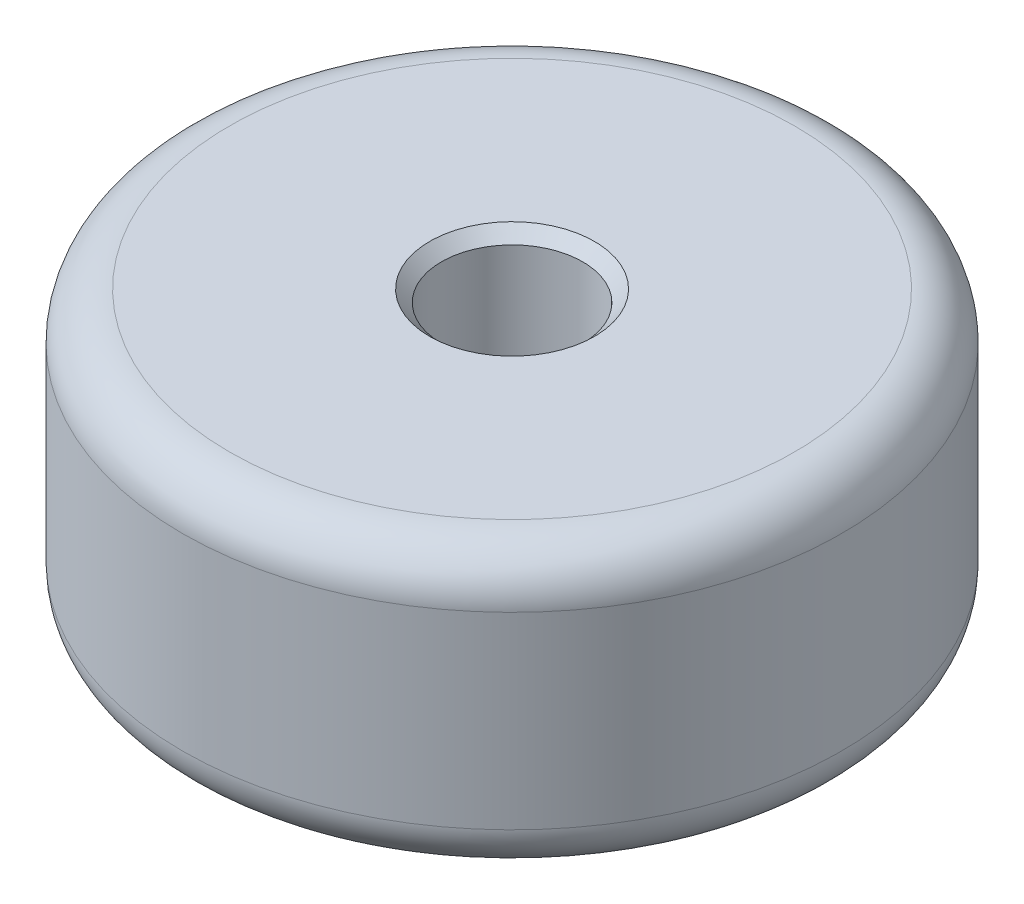
ISO-10303-21;
HEADER;
FILE_DESCRIPTION(('STEP AP214'),'2;1');
FILE_NAME('part.step','',(''),(''),'','','');
FILE_SCHEMA(('AUTOMOTIVE_DESIGN { 1 0 10303 214 1 1 1 1 }'));
ENDSEC;
DATA;
#1=APPLICATION_CONTEXT('core data for automotive mechanical design processes');
#2=APPLICATION_PROTOCOL_DEFINITION('international standard','automotive_design',2000,#1);
#3=PRODUCT_CONTEXT('',#1,'mechanical');
#4=PRODUCT('Part','Part','',(#3));
#5=PRODUCT_RELATED_PRODUCT_CATEGORY('part','',(#4));
#6=PRODUCT_DEFINITION_FORMATION('','',#4);
#7=PRODUCT_DEFINITION_CONTEXT('part definition',#1,'design');
#8=PRODUCT_DEFINITION('design','',#6,#7);
#9=PRODUCT_DEFINITION_SHAPE('','',#8);
#10=(LENGTH_UNIT() NAMED_UNIT(*) SI_UNIT(.MILLI.,.METRE.));
#11=(NAMED_UNIT(*) PLANE_ANGLE_UNIT() SI_UNIT($,.RADIAN.));
#12=(NAMED_UNIT(*) SI_UNIT($,.STERADIAN.) SOLID_ANGLE_UNIT());
#13=UNCERTAINTY_MEASURE_WITH_UNIT(LENGTH_MEASURE(1.E-05),#10,'distance_accuracy_value','');
#14=(GEOMETRIC_REPRESENTATION_CONTEXT(3) GLOBAL_UNCERTAINTY_ASSIGNED_CONTEXT((#13)) GLOBAL_UNIT_ASSIGNED_CONTEXT((#10,
#11,#12)) REPRESENTATION_CONTEXT('',''));
#15=CARTESIAN_POINT('',(0.,0.,0.));
#16=DIRECTION('',(0.,0.,1.));
#17=DIRECTION('',(1.,0.,0.));
#18=AXIS2_PLACEMENT_3D('',#15,#16,#17);
#19=CARTESIAN_POINT('',(0.,9.525,0.));
#20=DIRECTION('',(0.,1.,0.));
#21=DIRECTION('',(0.,0.,1.));
#22=AXIS2_PLACEMENT_3D('',#19,#20,#21);
#23=PLANE('',#22);
#24=CARTESIAN_POINT('',(0.,9.525,0.));
#25=DIRECTION('',(0.,1.,0.));
#26=DIRECTION('',(0.,0.,1.));
#27=AXIS2_PLACEMENT_3D('',#24,#25,#26);
#28=CIRCLE('',#27,2.77812500000001);
#29=CARTESIAN_POINT('',(0.,9.525,2.77812500000001));
#30=VERTEX_POINT('',#29);
#31=EDGE_CURVE('E10',#30,#30,#28,.F.);
#32=ORIENTED_EDGE('',*,*,#31,.T.);
#33=EDGE_LOOP('',(#32));
#34=FACE_BOUND('',#33,.T.);
#35=CARTESIAN_POINT('',(0.,9.525,0.));
#36=DIRECTION('',(0.,1.,0.));
#37=DIRECTION('',(0.,0.,1.));
#38=AXIS2_PLACEMENT_3D('',#35,#36,#37);
#39=CIRCLE('',#38,9.525);
#40=CARTESIAN_POINT('',(0.,9.525,9.525));
#41=VERTEX_POINT('',#40);
#42=EDGE_CURVE('E60',#41,#41,#39,.T.);
#43=ORIENTED_EDGE('',*,*,#42,.T.);
#44=EDGE_LOOP('',(#43));
#45=FACE_BOUND('',#44,.T.);
#46=ADVANCED_FACE('F39',(#34,#45),#23,.T.);
#47=CARTESIAN_POINT('',(0.,0.,0.));
#48=DIRECTION('',(0.,1.,0.));
#49=DIRECTION('',(0.,0.,1.));
#50=AXIS2_PLACEMENT_3D('',#47,#48,#49);
#51=PLANE('',#50);
#52=CARTESIAN_POINT('',(0.,0.,0.));
#53=DIRECTION('',(0.,1.,0.));
#54=DIRECTION('',(0.,0.,1.));
#55=AXIS2_PLACEMENT_3D('',#52,#53,#54);
#56=CIRCLE('',#55,2.778125);
#57=CARTESIAN_POINT('',(0.,0.,2.778125));
#58=VERTEX_POINT('',#57);
#59=EDGE_CURVE('E55',#58,#58,#56,.T.);
#60=ORIENTED_EDGE('',*,*,#59,.T.);
#61=EDGE_LOOP('',(#60));
#62=FACE_BOUND('',#61,.T.);
#63=CARTESIAN_POINT('',(0.,0.,0.));
#64=DIRECTION('',(0.,1.,0.));
#65=DIRECTION('',(0.,0.,1.));
#66=AXIS2_PLACEMENT_3D('',#63,#64,#65);
#67=CIRCLE('',#66,9.525);
#68=CARTESIAN_POINT('',(0.,0.,9.525));
#69=VERTEX_POINT('',#68);
#70=EDGE_CURVE('E63',#69,#69,#67,.F.);
#71=ORIENTED_EDGE('',*,*,#70,.T.);
#72=EDGE_LOOP('',(#71));
#73=FACE_BOUND('',#72,.T.);
#74=ADVANCED_FACE('F84',(#62,#73),#51,.F.);
#75=CARTESIAN_POINT('',(0.,9.525,0.));
#76=DIRECTION('',(0.,-1.,0.));
#77=DIRECTION('',(0.,0.,-1.));
#78=AXIS2_PLACEMENT_3D('',#75,#76,#77);
#79=CYLINDRICAL_SURFACE('',#78,11.1125);
#80=CARTESIAN_POINT('',(0.,1.5875,0.));
#81=DIRECTION('',(0.,1.,0.));
#82=DIRECTION('',(0.,0.,1.));
#83=AXIS2_PLACEMENT_3D('',#80,#81,#82);
#84=CIRCLE('',#83,11.1125);
#85=CARTESIAN_POINT('',(0.,1.5875,11.1125));
#86=VERTEX_POINT('',#85);
#87=EDGE_CURVE('E66',#86,#86,#84,.T.);
#88=ORIENTED_EDGE('',*,*,#87,.T.);
#89=EDGE_LOOP('',(#88));
#90=FACE_BOUND('',#89,.T.);
#91=CARTESIAN_POINT('',(0.,7.9375,0.));
#92=DIRECTION('',(0.,1.,0.));
#93=DIRECTION('',(0.,0.,1.));
#94=AXIS2_PLACEMENT_3D('',#91,#92,#93);
#95=CIRCLE('',#94,11.1125);
#96=CARTESIAN_POINT('',(0.,7.9375,11.1125));
#97=VERTEX_POINT('',#96);
#98=EDGE_CURVE('E69',#97,#97,#95,.F.);
#99=ORIENTED_EDGE('',*,*,#98,.T.);
#100=EDGE_LOOP('',(#99));
#101=FACE_BOUND('',#100,.T.);
#102=ADVANCED_FACE('F73',(#90,#101),#79,.T.);
#103=CARTESIAN_POINT('',(0.,9.525,0.));
#104=DIRECTION('',(0.,-1.,0.));
#105=DIRECTION('',(0.,0.,-1.));
#106=AXIS2_PLACEMENT_3D('',#103,#104,#105);
#107=CYLINDRICAL_SURFACE('',#106,2.38125);
#108=CARTESIAN_POINT('',(0.,0.396874999999998,0.));
#109=DIRECTION('',(0.,1.,0.));
#110=DIRECTION('',(0.,0.,1.));
#111=AXIS2_PLACEMENT_3D('',#108,#109,#110);
#112=CIRCLE('',#111,2.38125);
#113=CARTESIAN_POINT('',(0.,0.396874999999998,2.38125));
#114=VERTEX_POINT('',#113);
#115=EDGE_CURVE('E47',#114,#114,#112,.F.);
#116=ORIENTED_EDGE('',*,*,#115,.T.);
#117=EDGE_LOOP('',(#116));
#118=FACE_BOUND('',#117,.T.);
#119=CARTESIAN_POINT('',(0.,9.12812499999999,0.));
#120=DIRECTION('',(0.,1.,0.));
#121=DIRECTION('',(0.,0.,1.));
#122=AXIS2_PLACEMENT_3D('',#119,#120,#121);
#123=CIRCLE('',#122,2.38125);
#124=CARTESIAN_POINT('',(0.,9.12812499999999,2.38125));
#125=VERTEX_POINT('',#124);
#126=EDGE_CURVE('E51',#125,#125,#123,.T.);
#127=ORIENTED_EDGE('',*,*,#126,.T.);
#128=EDGE_LOOP('',(#127));
#129=FACE_BOUND('',#128,.T.);
#130=ADVANCED_FACE('F92',(#118,#129),#107,.F.);
#131=CARTESIAN_POINT('',(0.,1.5875,0.));
#132=DIRECTION('',(0.,1.,0.));
#133=DIRECTION('',(0.,0.,1.));
#134=AXIS2_PLACEMENT_3D('',#131,#132,#133);
#135=TOROIDAL_SURFACE('',#134,9.525,1.5875);
#136=ORIENTED_EDGE('',*,*,#70,.F.);
#137=EDGE_LOOP('',(#136));
#138=FACE_BOUND('',#137,.T.);
#139=ORIENTED_EDGE('',*,*,#87,.F.);
#140=EDGE_LOOP('',(#139));
#141=FACE_BOUND('',#140,.T.);
#142=ADVANCED_FACE('F79',(#138,#141),#135,.T.);
#143=CARTESIAN_POINT('',(0.,7.9375,0.));
#144=DIRECTION('',(0.,1.,0.));
#145=DIRECTION('',(0.,0.,1.));
#146=AXIS2_PLACEMENT_3D('',#143,#144,#145);
#147=TOROIDAL_SURFACE('',#146,9.525,1.5875);
#148=ORIENTED_EDGE('',*,*,#98,.F.);
#149=EDGE_LOOP('',(#148));
#150=FACE_BOUND('',#149,.T.);
#151=ORIENTED_EDGE('',*,*,#42,.F.);
#152=EDGE_LOOP('',(#151));
#153=FACE_BOUND('',#152,.T.);
#154=ADVANCED_FACE('F75',(#150,#153),#147,.T.);
#155=CARTESIAN_POINT('',(0.,0.,0.));
#156=DIRECTION('',(0.,-1.,0.));
#157=DIRECTION('',(0.,0.,-1.));
#158=AXIS2_PLACEMENT_3D('',#155,#156,#157);
#159=CONICAL_SURFACE('',#158,2.778125,0.785398163397445);
#160=ORIENTED_EDGE('',*,*,#115,.F.);
#161=EDGE_LOOP('',(#160));
#162=FACE_BOUND('',#161,.T.);
#163=ORIENTED_EDGE('',*,*,#59,.F.);
#164=EDGE_LOOP('',(#163));
#165=FACE_BOUND('',#164,.T.);
#166=ADVANCED_FACE('F78',(#162,#165),#159,.F.);
#167=CARTESIAN_POINT('',(0.,9.12812499999999,0.));
#168=DIRECTION('',(0.,1.,0.));
#169=DIRECTION('',(0.,0.,1.));
#170=AXIS2_PLACEMENT_3D('',#167,#168,#169);
#171=CONICAL_SURFACE('',#170,2.38125,0.785398163397454);
#172=ORIENTED_EDGE('',*,*,#31,.F.);
#173=EDGE_LOOP('',(#172));
#174=FACE_BOUND('',#173,.T.);
#175=ORIENTED_EDGE('',*,*,#126,.F.);
#176=EDGE_LOOP('',(#175));
#177=FACE_BOUND('',#176,.T.);
#178=ADVANCED_FACE('F42',(#174,#177),#171,.F.);
#179=CLOSED_SHELL('',(#46,#74,#102,#130,#142,#154,#166,#178));
#180=MANIFOLD_SOLID_BREP('B2',#179);
#181=ADVANCED_BREP_SHAPE_REPRESENTATION('',(#18,#180),#14);
#182=SHAPE_DEFINITION_REPRESENTATION(#9,#181);
ENDSEC;
END-ISO-10303-21;
